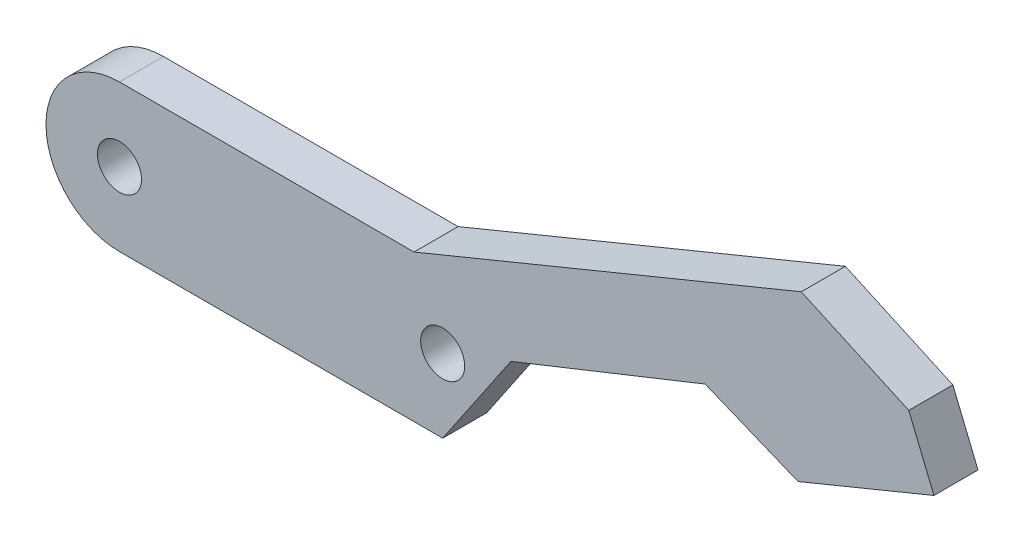
ISO-10303-21;
HEADER;
FILE_DESCRIPTION(('STEP AP214'),'2;1');
FILE_NAME('part.step','',(''),(''),'','','');
FILE_SCHEMA(('AUTOMOTIVE_DESIGN { 1 0 10303 214 1 1 1 1 }'));
ENDSEC;
DATA;
#1=APPLICATION_CONTEXT('core data for automotive mechanical design processes');
#2=APPLICATION_PROTOCOL_DEFINITION('international standard','automotive_design',2000,#1);
#3=PRODUCT_CONTEXT('',#1,'mechanical');
#4=PRODUCT('Part','Part','',(#3));
#5=PRODUCT_RELATED_PRODUCT_CATEGORY('part','',(#4));
#6=PRODUCT_DEFINITION_FORMATION('','',#4);
#7=PRODUCT_DEFINITION_CONTEXT('part definition',#1,'design');
#8=PRODUCT_DEFINITION('design','',#6,#7);
#9=PRODUCT_DEFINITION_SHAPE('','',#8);
#10=(LENGTH_UNIT() NAMED_UNIT(*) SI_UNIT(.MILLI.,.METRE.));
#11=(NAMED_UNIT(*) PLANE_ANGLE_UNIT() SI_UNIT($,.RADIAN.));
#12=(NAMED_UNIT(*) SI_UNIT($,.STERADIAN.) SOLID_ANGLE_UNIT());
#13=UNCERTAINTY_MEASURE_WITH_UNIT(LENGTH_MEASURE(1.E-05),#10,'distance_accuracy_value','');
#14=(GEOMETRIC_REPRESENTATION_CONTEXT(3) GLOBAL_UNCERTAINTY_ASSIGNED_CONTEXT((#13)) GLOBAL_UNIT_ASSIGNED_CONTEXT((#10,
#11,#12)) REPRESENTATION_CONTEXT('',''));
#15=CARTESIAN_POINT('',(0.,0.,0.));
#16=DIRECTION('',(0.,0.,1.));
#17=DIRECTION('',(1.,0.,0.));
#18=AXIS2_PLACEMENT_3D('',#15,#16,#17);
#19=CARTESIAN_POINT('',(17.3962094769041,-11.7918515015879,3.));
#20=DIRECTION('',(-0.827756870172505,0.561086948593727,0.));
#21=DIRECTION('',(-0.561086948593727,-0.827756870172505,0.));
#22=AXIS2_PLACEMENT_3D('',#19,#20,#21);
#23=PLANE('',#22);
#24=DIRECTION('',(0.561086948593727,0.827756870172505,0.));
#25=VECTOR('',#24,1.);
#26=CARTESIAN_POINT('',(17.3962094769041,-11.7918515015879,0.));
#27=LINE('',#26,#25);
#28=CARTESIAN_POINT('',(22.,-5.,0.));
#29=VERTEX_POINT('',#28);
#30=CARTESIAN_POINT('',(26.6444357646258,1.8518143611778,0.));
#31=VERTEX_POINT('',#30);
#32=EDGE_CURVE('E159',#29,#31,#27,.T.);
#33=ORIENTED_EDGE('',*,*,#32,.T.);
#34=DIRECTION('',(0.,0.,-1.));
#35=VECTOR('',#34,1.);
#36=CARTESIAN_POINT('',(26.6444357646258,1.8518143611778,3.));
#37=LINE('',#36,#35);
#38=CARTESIAN_POINT('',(26.6444357646258,1.8518143611778,3.));
#39=VERTEX_POINT('',#38);
#40=EDGE_CURVE('E11',#39,#31,#37,.T.);
#41=ORIENTED_EDGE('',*,*,#40,.F.);
#42=DIRECTION('',(0.561086948593727,0.827756870172505,0.));
#43=VECTOR('',#42,1.);
#44=CARTESIAN_POINT('',(17.3962094769041,-11.7918515015879,3.));
#45=LINE('',#44,#43);
#46=CARTESIAN_POINT('',(22.,-5.,3.));
#47=VERTEX_POINT('',#46);
#48=EDGE_CURVE('E105',#47,#39,#45,.T.);
#49=ORIENTED_EDGE('',*,*,#48,.F.);
#50=DIRECTION('',(0.,0.,-1.));
#51=VECTOR('',#50,1.);
#52=CARTESIAN_POINT('',(22.,-5.,3.));
#53=LINE('',#52,#51);
#54=EDGE_CURVE('E152',#47,#29,#53,.T.);
#55=ORIENTED_EDGE('',*,*,#54,.T.);
#56=EDGE_LOOP('',(#33,#41,#49,#55));
#57=FACE_BOUND('',#56,.T.);
#58=ADVANCED_FACE('F43',(#57),#23,.F.);
#59=CARTESIAN_POINT('',(3.01771045687263,-7.5685569066817,3.));
#60=DIRECTION('',(0.37036287223556,-0.928887152925169,0.));
#61=DIRECTION('',(0.928887152925169,0.37036287223556,0.));
#62=AXIS2_PLACEMENT_3D('',#59,#60,#61);
#63=PLANE('',#62);
#64=DIRECTION('',(-0.928887152925169,-0.37036287223556,0.));
#65=VECTOR('',#64,1.);
#66=CARTESIAN_POINT('',(3.01771045687263,-7.5685569066817,0.));
#67=LINE('',#66,#65);
#68=CARTESIAN_POINT('',(39.8717888222802,7.12578166181218,0.));
#69=VERTEX_POINT('',#68);
#70=EDGE_CURVE('E162',#69,#31,#67,.T.);
#71=ORIENTED_EDGE('',*,*,#70,.F.);
#72=DIRECTION('',(0.,0.,-1.));
#73=VECTOR('',#72,1.);
#74=CARTESIAN_POINT('',(39.8717888222802,7.12578166181218,3.));
#75=LINE('',#74,#73);
#76=CARTESIAN_POINT('',(39.8717888222802,7.12578166181218,3.));
#77=VERTEX_POINT('',#76);
#78=EDGE_CURVE('E52',#77,#69,#75,.T.);
#79=ORIENTED_EDGE('',*,*,#78,.F.);
#80=DIRECTION('',(-0.928887152925169,-0.37036287223556,0.));
#81=VECTOR('',#80,1.);
#82=CARTESIAN_POINT('',(3.01771045687263,-7.5685569066817,3.));
#83=LINE('',#82,#81);
#84=EDGE_CURVE('E216',#77,#39,#83,.T.);
#85=ORIENTED_EDGE('',*,*,#84,.T.);
#86=ORIENTED_EDGE('',*,*,#40,.T.);
#87=EDGE_LOOP('',(#71,#79,#85,#86));
#88=FACE_BOUND('',#87,.T.);
#89=ADVANCED_FACE('F203',(#88),#63,.T.);
#90=CARTESIAN_POINT('',(8.2207915456282,20.0822867610107,3.));
#91=DIRECTION('',(-0.378842481424519,-0.925461168427996,0.));
#92=DIRECTION('',(0.925461168427997,-0.37884248142452,0.));
#93=AXIS2_PLACEMENT_3D('',#90,#91,#92);
#94=PLANE('',#93);
#95=DIRECTION('',(-0.925461168427997,0.37884248142452,0.));
#96=VECTOR('',#95,1.);
#97=CARTESIAN_POINT('',(8.2207915456282,20.0822867610107,0.));
#98=LINE('',#97,#96);
#99=CARTESIAN_POINT('',(46.1884880253804,4.54000704246259,0.));
#100=VERTEX_POINT('',#99);
#101=EDGE_CURVE('E165',#100,#69,#98,.T.);
#102=ORIENTED_EDGE('',*,*,#101,.F.);
#103=DIRECTION('',(0.,0.,-1.));
#104=VECTOR('',#103,1.);
#105=CARTESIAN_POINT('',(46.1884880253804,4.54000704246259,3.));
#106=LINE('',#105,#104);
#107=CARTESIAN_POINT('',(46.1884880253804,4.54000704246259,3.));
#108=VERTEX_POINT('',#107);
#109=EDGE_CURVE('E193',#108,#100,#106,.T.);
#110=ORIENTED_EDGE('',*,*,#109,.F.);
#111=DIRECTION('',(-0.925461168427997,0.37884248142452,0.));
#112=VECTOR('',#111,1.);
#113=CARTESIAN_POINT('',(8.2207915456282,20.0822867610107,3.));
#114=LINE('',#113,#112);
#115=EDGE_CURVE('E200',#108,#77,#114,.T.);
#116=ORIENTED_EDGE('',*,*,#115,.T.);
#117=ORIENTED_EDGE('',*,*,#78,.T.);
#118=EDGE_LOOP('',(#102,#110,#116,#117));
#119=FACE_BOUND('',#118,.T.);
#120=ADVANCED_FACE('F198',(#119),#94,.T.);
#121=CARTESIAN_POINT('',(5.08215906678001,-12.3608480741269,3.));
#122=DIRECTION('',(0.380263412733199,-0.924878228166552,0.));
#123=DIRECTION('',(0.924878228166552,0.380263412733199,0.));
#124=AXIS2_PLACEMENT_3D('',#121,#122,#123);
#125=PLANE('',#124);
#126=DIRECTION('',(-0.924878228166552,-0.380263412733199,0.));
#127=VECTOR('',#126,1.);
#128=CARTESIAN_POINT('',(5.08215906678001,-12.3608480741269,0.));
#129=LINE('',#128,#127);
#130=CARTESIAN_POINT('',(55.4372703070459,8.34264116979459,0.));
#131=VERTEX_POINT('',#130);
#132=EDGE_CURVE('E168',#131,#100,#129,.T.);
#133=ORIENTED_EDGE('',*,*,#132,.F.);
#134=DIRECTION('',(0.,0.,-1.));
#135=VECTOR('',#134,1.);
#136=CARTESIAN_POINT('',(55.4372703070459,8.34264116979459,3.));
#137=LINE('',#136,#135);
#138=CARTESIAN_POINT('',(55.4372703070459,8.34264116979459,3.));
#139=VERTEX_POINT('',#138);
#140=EDGE_CURVE('E191',#139,#131,#137,.T.);
#141=ORIENTED_EDGE('',*,*,#140,.F.);
#142=DIRECTION('',(-0.924878228166552,-0.380263412733199,0.));
#143=VECTOR('',#142,1.);
#144=CARTESIAN_POINT('',(5.08215906678001,-12.3608480741269,3.));
#145=LINE('',#144,#143);
#146=EDGE_CURVE('E213',#139,#108,#145,.T.);
#147=ORIENTED_EDGE('',*,*,#146,.T.);
#148=ORIENTED_EDGE('',*,*,#109,.T.);
#149=EDGE_LOOP('',(#133,#141,#147,#148));
#150=FACE_BOUND('',#149,.T.);
#151=ADVANCED_FACE('F210',(#150),#125,.T.);
#152=CARTESIAN_POINT('',(50.3551112402657,20.7034892439217,3.));
#153=DIRECTION('',(0.92487822816655,0.380263412733204,0.));
#154=DIRECTION('',(-0.380263412733205,0.92487822816655,0.));
#155=AXIS2_PLACEMENT_3D('',#152,#153,#154);
#156=PLANE('',#155);
#157=DIRECTION('',(0.380263412733204,-0.92487822816655,0.));
#158=VECTOR('',#157,1.);
#159=CARTESIAN_POINT('',(50.3551112402657,20.7034892439217,0.));
#160=LINE('',#159,#158);
#161=CARTESIAN_POINT('',(53.7260849497465,12.5045931965441,0.));
#162=VERTEX_POINT('',#161);
#163=EDGE_CURVE('E171',#162,#131,#160,.T.);
#164=ORIENTED_EDGE('',*,*,#163,.F.);
#165=DIRECTION('',(0.,0.,-1.));
#166=VECTOR('',#165,1.);
#167=CARTESIAN_POINT('',(53.7260849497465,12.5045931965441,3.));
#168=LINE('',#167,#166);
#169=CARTESIAN_POINT('',(53.7260849497465,12.5045931965441,3.));
#170=VERTEX_POINT('',#169);
#171=EDGE_CURVE('E189',#170,#162,#168,.T.);
#172=ORIENTED_EDGE('',*,*,#171,.F.);
#173=DIRECTION('',(0.380263412733204,-0.92487822816655,0.));
#174=VECTOR('',#173,1.);
#175=CARTESIAN_POINT('',(50.3551112402657,20.7034892439217,3.));
#176=LINE('',#175,#174);
#177=EDGE_CURVE('E218',#170,#139,#176,.T.);
#178=ORIENTED_EDGE('',*,*,#177,.T.);
#179=ORIENTED_EDGE('',*,*,#140,.T.);
#180=EDGE_LOOP('',(#164,#172,#178,#179));
#181=FACE_BOUND('',#180,.T.);
#182=ADVANCED_FACE('F321',(#181),#156,.T.);
#183=CARTESIAN_POINT('',(13.9488099268586,30.6231164748254,3.));
#184=DIRECTION('',(0.414522259932094,0.91003917279466,0.));
#185=DIRECTION('',(-0.910039172794661,0.414522259932094,0.));
#186=AXIS2_PLACEMENT_3D('',#183,#184,#185);
#187=PLANE('',#186);
#188=DIRECTION('',(0.910039172794661,-0.414522259932094,0.));
#189=VECTOR('',#188,1.);
#190=CARTESIAN_POINT('',(13.9488099268586,30.6231164748254,0.));
#191=LINE('',#190,#189);
#192=CARTESIAN_POINT('',(46.4090295027467,15.8375072628962,0.));
#193=VERTEX_POINT('',#192);
#194=EDGE_CURVE('E174',#193,#162,#191,.T.);
#195=ORIENTED_EDGE('',*,*,#194,.F.);
#196=DIRECTION('',(0.,0.,-1.));
#197=VECTOR('',#196,1.);
#198=CARTESIAN_POINT('',(46.4090295027467,15.8375072628962,3.));
#199=LINE('',#198,#197);
#200=CARTESIAN_POINT('',(46.4090295027467,15.8375072628962,3.));
#201=VERTEX_POINT('',#200);
#202=EDGE_CURVE('E187',#201,#193,#199,.T.);
#203=ORIENTED_EDGE('',*,*,#202,.F.);
#204=DIRECTION('',(0.910039172794661,-0.414522259932094,0.));
#205=VECTOR('',#204,1.);
#206=CARTESIAN_POINT('',(13.9488099268586,30.6231164748254,3.));
#207=LINE('',#206,#205);
#208=EDGE_CURVE('E147',#201,#170,#207,.T.);
#209=ORIENTED_EDGE('',*,*,#208,.T.);
#210=ORIENTED_EDGE('',*,*,#171,.T.);
#211=EDGE_LOOP('',(#195,#203,#209,#210));
#212=FACE_BOUND('',#211,.T.);
#213=ADVANCED_FACE('F226',(#212),#187,.T.);
#214=CARTESIAN_POINT('',(1.14074851739693,-2.77453321099271,3.));
#215=DIRECTION('',(-0.380263412733199,0.924878228166552,0.));
#216=DIRECTION('',(-0.924878228166552,-0.380263412733199,0.));
#217=AXIS2_PLACEMENT_3D('',#214,#215,#216);
#218=PLANE('',#217);
#219=DIRECTION('',(0.924878228166552,0.380263412733199,0.));
#220=VECTOR('',#219,1.);
#221=CARTESIAN_POINT('',(1.14074851739693,-2.77453321099271,0.));
#222=LINE('',#221,#220);
#223=CARTESIAN_POINT('',(20.05,5.,0.));
#224=VERTEX_POINT('',#223);
#225=EDGE_CURVE('E177',#224,#193,#222,.T.);
#226=ORIENTED_EDGE('',*,*,#225,.F.);
#227=DIRECTION('',(0.,0.,-1.));
#228=VECTOR('',#227,1.);
#229=CARTESIAN_POINT('',(20.05,5.,3.));
#230=LINE('',#229,#228);
#231=CARTESIAN_POINT('',(20.05,5.,3.));
#232=VERTEX_POINT('',#231);
#233=EDGE_CURVE('E135',#232,#224,#230,.T.);
#234=ORIENTED_EDGE('',*,*,#233,.F.);
#235=DIRECTION('',(0.924878228166552,0.380263412733199,0.));
#236=VECTOR('',#235,1.);
#237=CARTESIAN_POINT('',(1.14074851739693,-2.77453321099271,3.));
#238=LINE('',#237,#236);
#239=EDGE_CURVE('E145',#232,#201,#238,.T.);
#240=ORIENTED_EDGE('',*,*,#239,.T.);
#241=ORIENTED_EDGE('',*,*,#202,.T.);
#242=EDGE_LOOP('',(#226,#234,#240,#241));
#243=FACE_BOUND('',#242,.T.);
#244=ADVANCED_FACE('F229',(#243),#218,.T.);
#245=CARTESIAN_POINT('',(0.,5.,3.));
#246=DIRECTION('',(0.,1.,0.));
#247=DIRECTION('',(0.,0.,1.));
#248=AXIS2_PLACEMENT_3D('',#245,#246,#247);
#249=PLANE('',#248);
#250=DIRECTION('',(1.,0.,0.));
#251=VECTOR('',#250,1.);
#252=CARTESIAN_POINT('',(0.,5.,0.));
#253=LINE('',#252,#251);
#254=CARTESIAN_POINT('',(0.,5.,0.));
#255=VERTEX_POINT('',#254);
#256=EDGE_CURVE('E134',#255,#224,#253,.T.);
#257=ORIENTED_EDGE('',*,*,#256,.F.);
#258=DIRECTION('',(0.,0.,-1.));
#259=VECTOR('',#258,1.);
#260=CARTESIAN_POINT('',(0.,5.,3.));
#261=LINE('',#260,#259);
#262=CARTESIAN_POINT('',(0.,5.,3.));
#263=VERTEX_POINT('',#262);
#264=EDGE_CURVE('E128',#263,#255,#261,.T.);
#265=ORIENTED_EDGE('',*,*,#264,.F.);
#266=DIRECTION('',(1.,0.,0.));
#267=VECTOR('',#266,1.);
#268=CARTESIAN_POINT('',(0.,5.,3.));
#269=LINE('',#268,#267);
#270=EDGE_CURVE('E132',#263,#232,#269,.T.);
#271=ORIENTED_EDGE('',*,*,#270,.T.);
#272=ORIENTED_EDGE('',*,*,#233,.T.);
#273=EDGE_LOOP('',(#257,#265,#271,#272));
#274=FACE_BOUND('',#273,.T.);
#275=ADVANCED_FACE('F130',(#274),#249,.T.);
#276=CARTESIAN_POINT('',(0.,0.,3.));
#277=DIRECTION('',(0.,0.,-1.));
#278=DIRECTION('',(-1.,0.,0.));
#279=AXIS2_PLACEMENT_3D('',#276,#277,#278);
#280=CYLINDRICAL_SURFACE('',#279,5.);
#281=CARTESIAN_POINT('',(0.,0.,0.));
#282=DIRECTION('',(0.,0.,1.));
#283=DIRECTION('',(1.,0.,0.));
#284=AXIS2_PLACEMENT_3D('',#281,#282,#283);
#285=CIRCLE('',#284,5.);
#286=CARTESIAN_POINT('',(0.,-5.,0.));
#287=VERTEX_POINT('',#286);
#288=EDGE_CURVE('E93',#255,#287,#285,.T.);
#289=ORIENTED_EDGE('',*,*,#288,.T.);
#290=DIRECTION('',(0.,0.,-1.));
#291=VECTOR('',#290,1.);
#292=CARTESIAN_POINT('',(0.,-5.,3.));
#293=LINE('',#292,#291);
#294=CARTESIAN_POINT('',(0.,-5.,3.));
#295=VERTEX_POINT('',#294);
#296=EDGE_CURVE('E136',#295,#287,#293,.T.);
#297=ORIENTED_EDGE('',*,*,#296,.F.);
#298=CARTESIAN_POINT('',(0.,0.,3.));
#299=DIRECTION('',(0.,0.,1.));
#300=DIRECTION('',(1.,0.,0.));
#301=AXIS2_PLACEMENT_3D('',#298,#299,#300);
#302=CIRCLE('',#301,5.);
#303=EDGE_CURVE('E138',#263,#295,#302,.T.);
#304=ORIENTED_EDGE('',*,*,#303,.F.);
#305=ORIENTED_EDGE('',*,*,#264,.T.);
#306=EDGE_LOOP('',(#289,#297,#304,#305));
#307=FACE_BOUND('',#306,.T.);
#308=ADVANCED_FACE('F139',(#307),#280,.T.);
#309=CARTESIAN_POINT('',(22.,0.,3.));
#310=DIRECTION('',(0.,0.,-1.));
#311=DIRECTION('',(-1.,0.,0.));
#312=AXIS2_PLACEMENT_3D('',#309,#310,#311);
#313=CYLINDRICAL_SURFACE('',#312,1.5);
#314=CARTESIAN_POINT('',(22.,0.,3.));
#315=DIRECTION('',(0.,0.,1.));
#316=DIRECTION('',(1.,0.,0.));
#317=AXIS2_PLACEMENT_3D('',#314,#315,#316);
#318=CIRCLE('',#317,1.5);
#319=CARTESIAN_POINT('',(23.5,0.,3.));
#320=VERTEX_POINT('',#319);
#321=EDGE_CURVE('E259',#320,#320,#318,.T.);
#322=ORIENTED_EDGE('',*,*,#321,.T.);
#323=EDGE_LOOP('',(#322));
#324=FACE_BOUND('',#323,.T.);
#325=CARTESIAN_POINT('',(22.,0.,0.));
#326=DIRECTION('',(0.,0.,1.));
#327=DIRECTION('',(1.,0.,0.));
#328=AXIS2_PLACEMENT_3D('',#325,#326,#327);
#329=CIRCLE('',#328,1.5);
#330=CARTESIAN_POINT('',(23.5,0.,0.));
#331=VERTEX_POINT('',#330);
#332=EDGE_CURVE('E156',#331,#331,#329,.T.);
#333=ORIENTED_EDGE('',*,*,#332,.F.);
#334=EDGE_LOOP('',(#333));
#335=FACE_BOUND('',#334,.T.);
#336=ADVANCED_FACE('F240',(#324,#335),#313,.F.);
#337=CARTESIAN_POINT('',(0.,0.,3.));
#338=DIRECTION('',(0.,0.,-1.));
#339=DIRECTION('',(-1.,0.,0.));
#340=AXIS2_PLACEMENT_3D('',#337,#338,#339);
#341=CYLINDRICAL_SURFACE('',#340,1.5);
#342=CARTESIAN_POINT('',(0.,0.,3.));
#343=DIRECTION('',(0.,0.,1.));
#344=DIRECTION('',(1.,0.,0.));
#345=AXIS2_PLACEMENT_3D('',#342,#343,#344);
#346=CIRCLE('',#345,1.5);
#347=CARTESIAN_POINT('',(1.5,0.,3.));
#348=VERTEX_POINT('',#347);
#349=EDGE_CURVE('E183',#348,#348,#346,.T.);
#350=ORIENTED_EDGE('',*,*,#349,.T.);
#351=EDGE_LOOP('',(#350));
#352=FACE_BOUND('',#351,.T.);
#353=CARTESIAN_POINT('',(0.,0.,0.));
#354=DIRECTION('',(0.,0.,1.));
#355=DIRECTION('',(1.,0.,0.));
#356=AXIS2_PLACEMENT_3D('',#353,#354,#355);
#357=CIRCLE('',#356,1.5);
#358=CARTESIAN_POINT('',(1.5,0.,0.));
#359=VERTEX_POINT('',#358);
#360=EDGE_CURVE('E153',#359,#359,#357,.T.);
#361=ORIENTED_EDGE('',*,*,#360,.F.);
#362=EDGE_LOOP('',(#361));
#363=FACE_BOUND('',#362,.T.);
#364=ADVANCED_FACE('F45',(#352,#363),#341,.F.);
#365=CARTESIAN_POINT('',(0.,-5.,3.));
#366=DIRECTION('',(0.,1.,0.));
#367=DIRECTION('',(0.,0.,1.));
#368=AXIS2_PLACEMENT_3D('',#365,#366,#367);
#369=PLANE('',#368);
#370=DIRECTION('',(1.,0.,0.));
#371=VECTOR('',#370,1.);
#372=CARTESIAN_POINT('',(0.,-5.,0.));
#373=LINE('',#372,#371);
#374=EDGE_CURVE('E99',#287,#29,#373,.T.);
#375=ORIENTED_EDGE('',*,*,#374,.T.);
#376=ORIENTED_EDGE('',*,*,#54,.F.);
#377=DIRECTION('',(1.,0.,0.));
#378=VECTOR('',#377,1.);
#379=CARTESIAN_POINT('',(0.,-5.,3.));
#380=LINE('',#379,#378);
#381=EDGE_CURVE('E60',#295,#47,#380,.T.);
#382=ORIENTED_EDGE('',*,*,#381,.F.);
#383=ORIENTED_EDGE('',*,*,#296,.T.);
#384=EDGE_LOOP('',(#375,#376,#382,#383));
#385=FACE_BOUND('',#384,.T.);
#386=ADVANCED_FACE('F231',(#385),#369,.F.);
#387=CARTESIAN_POINT('',(0.,0.,3.));
#388=DIRECTION('',(0.,0.,1.));
#389=DIRECTION('',(1.,0.,0.));
#390=AXIS2_PLACEMENT_3D('',#387,#388,#389);
#391=PLANE('',#390);
#392=ORIENTED_EDGE('',*,*,#349,.F.);
#393=EDGE_LOOP('',(#392));
#394=FACE_BOUND('',#393,.T.);
#395=ORIENTED_EDGE('',*,*,#321,.F.);
#396=EDGE_LOOP('',(#395));
#397=FACE_BOUND('',#396,.T.);
#398=ORIENTED_EDGE('',*,*,#48,.T.);
#399=ORIENTED_EDGE('',*,*,#84,.F.);
#400=ORIENTED_EDGE('',*,*,#115,.F.);
#401=ORIENTED_EDGE('',*,*,#146,.F.);
#402=ORIENTED_EDGE('',*,*,#177,.F.);
#403=ORIENTED_EDGE('',*,*,#208,.F.);
#404=ORIENTED_EDGE('',*,*,#239,.F.);
#405=ORIENTED_EDGE('',*,*,#270,.F.);
#406=ORIENTED_EDGE('',*,*,#303,.T.);
#407=ORIENTED_EDGE('',*,*,#381,.T.);
#408=EDGE_LOOP('',(#398,#399,#400,#401,#402,#403,#404,#405,#406,#407));
#409=FACE_BOUND('',#408,.T.);
#410=ADVANCED_FACE('F142',(#394,#397,#409),#391,.T.);
#411=CARTESIAN_POINT('',(0.,0.,0.));
#412=DIRECTION('',(0.,0.,1.));
#413=DIRECTION('',(1.,0.,0.));
#414=AXIS2_PLACEMENT_3D('',#411,#412,#413);
#415=PLANE('',#414);
#416=ORIENTED_EDGE('',*,*,#360,.T.);
#417=EDGE_LOOP('',(#416));
#418=FACE_BOUND('',#417,.T.);
#419=ORIENTED_EDGE('',*,*,#332,.T.);
#420=EDGE_LOOP('',(#419));
#421=FACE_BOUND('',#420,.T.);
#422=ORIENTED_EDGE('',*,*,#32,.F.);
#423=ORIENTED_EDGE('',*,*,#374,.F.);
#424=ORIENTED_EDGE('',*,*,#288,.F.);
#425=ORIENTED_EDGE('',*,*,#256,.T.);
#426=ORIENTED_EDGE('',*,*,#225,.T.);
#427=ORIENTED_EDGE('',*,*,#194,.T.);
#428=ORIENTED_EDGE('',*,*,#163,.T.);
#429=ORIENTED_EDGE('',*,*,#132,.T.);
#430=ORIENTED_EDGE('',*,*,#101,.T.);
#431=ORIENTED_EDGE('',*,*,#70,.T.);
#432=EDGE_LOOP('',(#422,#423,#424,#425,#426,#427,#428,#429,#430,#431));
#433=FACE_BOUND('',#432,.T.);
#434=ADVANCED_FACE('F206',(#418,#421,#433),#415,.F.);
#435=CLOSED_SHELL('',(#58,#89,#120,#151,#182,#213,#244,#275,#308,#336,#364,#386,#410,#434));
#436=MANIFOLD_SOLID_BREP('B2',#435);
#437=ADVANCED_BREP_SHAPE_REPRESENTATION('',(#18,#436),#14);
#438=SHAPE_DEFINITION_REPRESENTATION(#9,#437);
ENDSEC;
END-ISO-10303-21;
